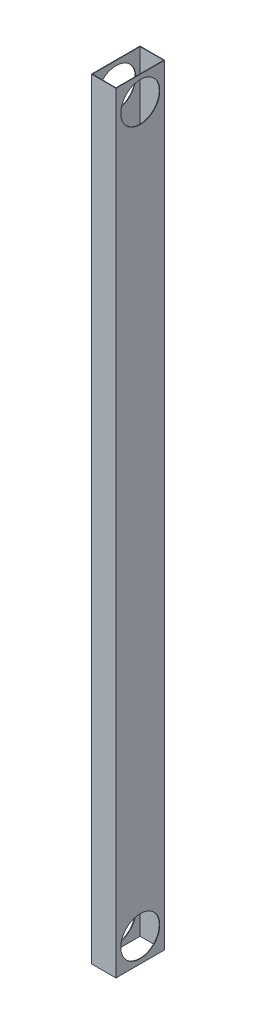
ISO-10303-21;
HEADER;
FILE_DESCRIPTION(('STEP AP214'),'2;1');
FILE_NAME('part.step','',(''),(''),'','','');
FILE_SCHEMA(('AUTOMOTIVE_DESIGN { 1 0 10303 214 1 1 1 1 }'));
ENDSEC;
DATA;
#1=APPLICATION_CONTEXT('core data for automotive mechanical design processes');
#2=APPLICATION_PROTOCOL_DEFINITION('international standard','automotive_design',2000,#1);
#3=PRODUCT_CONTEXT('',#1,'mechanical');
#4=PRODUCT('Part','Part','',(#3));
#5=PRODUCT_RELATED_PRODUCT_CATEGORY('part','',(#4));
#6=PRODUCT_DEFINITION_FORMATION('','',#4);
#7=PRODUCT_DEFINITION_CONTEXT('part definition',#1,'design');
#8=PRODUCT_DEFINITION('design','',#6,#7);
#9=PRODUCT_DEFINITION_SHAPE('','',#8);
#10=(LENGTH_UNIT() NAMED_UNIT(*) SI_UNIT(.MILLI.,.METRE.));
#11=(NAMED_UNIT(*) PLANE_ANGLE_UNIT() SI_UNIT($,.RADIAN.));
#12=(NAMED_UNIT(*) SI_UNIT($,.STERADIAN.) SOLID_ANGLE_UNIT());
#13=UNCERTAINTY_MEASURE_WITH_UNIT(LENGTH_MEASURE(1.E-05),#10,'distance_accuracy_value','');
#14=(GEOMETRIC_REPRESENTATION_CONTEXT(3) GLOBAL_UNCERTAINTY_ASSIGNED_CONTEXT((#13)) GLOBAL_UNIT_ASSIGNED_CONTEXT((#10,
#11,#12)) REPRESENTATION_CONTEXT('',''));
#15=CARTESIAN_POINT('',(0.,0.,0.));
#16=DIRECTION('',(0.,0.,1.));
#17=DIRECTION('',(1.,0.,0.));
#18=AXIS2_PLACEMENT_3D('',#15,#16,#17);
#19=CARTESIAN_POINT('',(25.5,1600.,0.));
#20=DIRECTION('',(1.,0.,0.));
#21=DIRECTION('',(0.,0.,-1.));
#22=AXIS2_PLACEMENT_3D('',#19,#20,#21);
#23=PLANE('',#22);
#24=CARTESIAN_POINT('',(25.5,50.,0.));
#25=DIRECTION('',(-1.,0.,0.));
#26=DIRECTION('',(0.,0.,1.));
#27=AXIS2_PLACEMENT_3D('',#24,#25,#26);
#28=CIRCLE('',#27,40.5);
#29=CARTESIAN_POINT('',(25.5,50.,40.5));
#30=VERTEX_POINT('',#29);
#31=EDGE_CURVE('E193',#30,#30,#28,.T.);
#32=ORIENTED_EDGE('',*,*,#31,.T.);
#33=EDGE_LOOP('',(#32));
#34=FACE_BOUND('',#33,.T.);
#35=CARTESIAN_POINT('',(25.5,1550.,0.));
#36=DIRECTION('',(-1.,0.,0.));
#37=DIRECTION('',(0.,0.,1.));
#38=AXIS2_PLACEMENT_3D('',#35,#36,#37);
#39=CIRCLE('',#38,40.5);
#40=CARTESIAN_POINT('',(25.5,1550.,40.5));
#41=VERTEX_POINT('',#40);
#42=EDGE_CURVE('E207',#41,#41,#39,.T.);
#43=ORIENTED_EDGE('',*,*,#42,.T.);
#44=EDGE_LOOP('',(#43));
#45=FACE_BOUND('',#44,.T.);
#46=DIRECTION('',(0.,0.,1.));
#47=VECTOR('',#46,1.);
#48=CARTESIAN_POINT('',(25.5,0.,0.));
#49=LINE('',#48,#47);
#50=CARTESIAN_POINT('',(25.5,0.,-50.5));
#51=VERTEX_POINT('',#50);
#52=CARTESIAN_POINT('',(25.5,0.,50.5));
#53=VERTEX_POINT('',#52);
#54=EDGE_CURVE('E164',#51,#53,#49,.T.);
#55=ORIENTED_EDGE('',*,*,#54,.F.);
#56=DIRECTION('',(0.,-1.,0.));
#57=VECTOR('',#56,1.);
#58=CARTESIAN_POINT('',(25.5,1600.,-50.5));
#59=LINE('',#58,#57);
#60=CARTESIAN_POINT('',(25.5,1600.,-50.5));
#61=VERTEX_POINT('',#60);
#62=EDGE_CURVE('E11',#61,#51,#59,.T.);
#63=ORIENTED_EDGE('',*,*,#62,.F.);
#64=DIRECTION('',(0.,0.,1.));
#65=VECTOR('',#64,1.);
#66=CARTESIAN_POINT('',(25.5,1600.,0.));
#67=LINE('',#66,#65);
#68=CARTESIAN_POINT('',(25.5,1600.,50.5));
#69=VERTEX_POINT('',#68);
#70=EDGE_CURVE('E137',#61,#69,#67,.T.);
#71=ORIENTED_EDGE('',*,*,#70,.T.);
#72=DIRECTION('',(0.,-1.,0.));
#73=VECTOR('',#72,1.);
#74=CARTESIAN_POINT('',(25.5,1600.,50.5));
#75=LINE('',#74,#73);
#76=EDGE_CURVE('E96',#69,#53,#75,.T.);
#77=ORIENTED_EDGE('',*,*,#76,.T.);
#78=EDGE_LOOP('',(#55,#63,#71,#77));
#79=FACE_BOUND('',#78,.T.);
#80=ADVANCED_FACE('F41',(#34,#45,#79),#23,.T.);
#81=CARTESIAN_POINT('',(0.,1600.,-50.5));
#82=DIRECTION('',(0.,0.,-1.));
#83=DIRECTION('',(-1.,0.,0.));
#84=AXIS2_PLACEMENT_3D('',#81,#82,#83);
#85=PLANE('',#84);
#86=DIRECTION('',(1.,0.,0.));
#87=VECTOR('',#86,1.);
#88=CARTESIAN_POINT('',(0.,0.,-50.5));
#89=LINE('',#88,#87);
#90=CARTESIAN_POINT('',(-25.5,0.,-50.5));
#91=VERTEX_POINT('',#90);
#92=EDGE_CURVE('E125',#91,#51,#89,.T.);
#93=ORIENTED_EDGE('',*,*,#92,.F.);
#94=DIRECTION('',(0.,-1.,0.));
#95=VECTOR('',#94,1.);
#96=CARTESIAN_POINT('',(-25.5,1600.,-50.5));
#97=LINE('',#96,#95);
#98=CARTESIAN_POINT('',(-25.5,1600.,-50.5));
#99=VERTEX_POINT('',#98);
#100=EDGE_CURVE('E52',#99,#91,#97,.T.);
#101=ORIENTED_EDGE('',*,*,#100,.F.);
#102=DIRECTION('',(1.,0.,0.));
#103=VECTOR('',#102,1.);
#104=CARTESIAN_POINT('',(0.,1600.,-50.5));
#105=LINE('',#104,#103);
#106=EDGE_CURVE('E123',#99,#61,#105,.T.);
#107=ORIENTED_EDGE('',*,*,#106,.T.);
#108=ORIENTED_EDGE('',*,*,#62,.T.);
#109=EDGE_LOOP('',(#93,#101,#107,#108));
#110=FACE_BOUND('',#109,.T.);
#111=ADVANCED_FACE('F121',(#110),#85,.T.);
#112=CARTESIAN_POINT('',(-25.5,1600.,0.));
#113=DIRECTION('',(1.,0.,0.));
#114=DIRECTION('',(0.,0.,-1.));
#115=AXIS2_PLACEMENT_3D('',#112,#113,#114);
#116=PLANE('',#115);
#117=CARTESIAN_POINT('',(-25.5,50.,0.));
#118=DIRECTION('',(-1.,0.,0.));
#119=DIRECTION('',(0.,0.,1.));
#120=AXIS2_PLACEMENT_3D('',#117,#118,#119);
#121=CIRCLE('',#120,40.5);
#122=CARTESIAN_POINT('',(-25.5,50.,40.5));
#123=VERTEX_POINT('',#122);
#124=EDGE_CURVE('E201',#123,#123,#121,.T.);
#125=ORIENTED_EDGE('',*,*,#124,.F.);
#126=EDGE_LOOP('',(#125));
#127=FACE_BOUND('',#126,.T.);
#128=CARTESIAN_POINT('',(-25.5,1550.,0.));
#129=DIRECTION('',(-1.,0.,0.));
#130=DIRECTION('',(0.,0.,1.));
#131=AXIS2_PLACEMENT_3D('',#128,#129,#130);
#132=CIRCLE('',#131,40.5);
#133=CARTESIAN_POINT('',(-25.5,1550.,40.5));
#134=VERTEX_POINT('',#133);
#135=EDGE_CURVE('E213',#134,#134,#132,.T.);
#136=ORIENTED_EDGE('',*,*,#135,.F.);
#137=EDGE_LOOP('',(#136));
#138=FACE_BOUND('',#137,.T.);
#139=DIRECTION('',(0.,0.,1.));
#140=VECTOR('',#139,1.);
#141=CARTESIAN_POINT('',(-25.5,0.,0.));
#142=LINE('',#141,#140);
#143=CARTESIAN_POINT('',(-25.5,0.,50.5));
#144=VERTEX_POINT('',#143);
#145=EDGE_CURVE('E169',#91,#144,#142,.T.);
#146=ORIENTED_EDGE('',*,*,#145,.T.);
#147=DIRECTION('',(0.,-1.,0.));
#148=VECTOR('',#147,1.);
#149=CARTESIAN_POINT('',(-25.5,1600.,50.5));
#150=LINE('',#149,#148);
#151=CARTESIAN_POINT('',(-25.5,1600.,50.5));
#152=VERTEX_POINT('',#151);
#153=EDGE_CURVE('E129',#152,#144,#150,.T.);
#154=ORIENTED_EDGE('',*,*,#153,.F.);
#155=DIRECTION('',(0.,0.,1.));
#156=VECTOR('',#155,1.);
#157=CARTESIAN_POINT('',(-25.5,1600.,0.));
#158=LINE('',#157,#156);
#159=EDGE_CURVE('E132',#99,#152,#158,.T.);
#160=ORIENTED_EDGE('',*,*,#159,.F.);
#161=ORIENTED_EDGE('',*,*,#100,.T.);
#162=EDGE_LOOP('',(#146,#154,#160,#161));
#163=FACE_BOUND('',#162,.T.);
#164=ADVANCED_FACE('F133',(#127,#138,#163),#116,.F.);
#165=CARTESIAN_POINT('',(-24.5,1600.,0.));
#166=DIRECTION('',(1.,0.,0.));
#167=DIRECTION('',(0.,0.,-1.));
#168=AXIS2_PLACEMENT_3D('',#165,#166,#167);
#169=PLANE('',#168);
#170=CARTESIAN_POINT('',(-24.5,50.,0.));
#171=DIRECTION('',(1.,0.,0.));
#172=DIRECTION('',(0.,0.,-1.));
#173=AXIS2_PLACEMENT_3D('',#170,#171,#172);
#174=CIRCLE('',#173,40.5);
#175=CARTESIAN_POINT('',(-24.5,50.,-40.5));
#176=VERTEX_POINT('',#175);
#177=EDGE_CURVE('E153',#176,#176,#174,.T.);
#178=ORIENTED_EDGE('',*,*,#177,.F.);
#179=EDGE_LOOP('',(#178));
#180=FACE_BOUND('',#179,.T.);
#181=CARTESIAN_POINT('',(-24.5,1550.,0.));
#182=DIRECTION('',(1.,0.,0.));
#183=DIRECTION('',(0.,0.,-1.));
#184=AXIS2_PLACEMENT_3D('',#181,#182,#183);
#185=CIRCLE('',#184,40.5);
#186=CARTESIAN_POINT('',(-24.5,1550.,-40.5));
#187=VERTEX_POINT('',#186);
#188=EDGE_CURVE('E192',#187,#187,#185,.T.);
#189=ORIENTED_EDGE('',*,*,#188,.F.);
#190=EDGE_LOOP('',(#189));
#191=FACE_BOUND('',#190,.T.);
#192=DIRECTION('',(0.,0.,1.));
#193=VECTOR('',#192,1.);
#194=CARTESIAN_POINT('',(-24.5,0.,0.));
#195=LINE('',#194,#193);
#196=CARTESIAN_POINT('',(-24.5,0.,-49.5));
#197=VERTEX_POINT('',#196);
#198=CARTESIAN_POINT('',(-24.5,0.,49.5));
#199=VERTEX_POINT('',#198);
#200=EDGE_CURVE('E148',#197,#199,#195,.T.);
#201=ORIENTED_EDGE('',*,*,#200,.F.);
#202=DIRECTION('',(0.,-1.,0.));
#203=VECTOR('',#202,1.);
#204=CARTESIAN_POINT('',(-24.5,1600.,-49.5));
#205=LINE('',#204,#203);
#206=CARTESIAN_POINT('',(-24.5,1600.,-49.5));
#207=VERTEX_POINT('',#206);
#208=EDGE_CURVE('E103',#207,#197,#205,.T.);
#209=ORIENTED_EDGE('',*,*,#208,.F.);
#210=DIRECTION('',(0.,0.,1.));
#211=VECTOR('',#210,1.);
#212=CARTESIAN_POINT('',(-24.5,1600.,0.));
#213=LINE('',#212,#211);
#214=CARTESIAN_POINT('',(-24.5,1600.,49.5));
#215=VERTEX_POINT('',#214);
#216=EDGE_CURVE('E174',#207,#215,#213,.T.);
#217=ORIENTED_EDGE('',*,*,#216,.T.);
#218=DIRECTION('',(0.,-1.,0.));
#219=VECTOR('',#218,1.);
#220=CARTESIAN_POINT('',(-24.5,1600.,49.5));
#221=LINE('',#220,#219);
#222=EDGE_CURVE('E147',#215,#199,#221,.T.);
#223=ORIENTED_EDGE('',*,*,#222,.T.);
#224=EDGE_LOOP('',(#201,#209,#217,#223));
#225=FACE_BOUND('',#224,.T.);
#226=ADVANCED_FACE('F43',(#180,#191,#225),#169,.T.);
#227=CARTESIAN_POINT('',(0.,1600.,-49.5));
#228=DIRECTION('',(0.,0.,-1.));
#229=DIRECTION('',(-1.,0.,0.));
#230=AXIS2_PLACEMENT_3D('',#227,#228,#229);
#231=PLANE('',#230);
#232=DIRECTION('',(1.,0.,0.));
#233=VECTOR('',#232,1.);
#234=CARTESIAN_POINT('',(0.,0.,-49.5));
#235=LINE('',#234,#233);
#236=CARTESIAN_POINT('',(24.5,0.,-49.5));
#237=VERTEX_POINT('',#236);
#238=EDGE_CURVE('E152',#197,#237,#235,.T.);
#239=ORIENTED_EDGE('',*,*,#238,.T.);
#240=DIRECTION('',(0.,-1.,0.));
#241=VECTOR('',#240,1.);
#242=CARTESIAN_POINT('',(24.5,1600.,-49.5));
#243=LINE('',#242,#241);
#244=CARTESIAN_POINT('',(24.5,1600.,-49.5));
#245=VERTEX_POINT('',#244);
#246=EDGE_CURVE('E184',#245,#237,#243,.T.);
#247=ORIENTED_EDGE('',*,*,#246,.F.);
#248=DIRECTION('',(1.,0.,0.));
#249=VECTOR('',#248,1.);
#250=CARTESIAN_POINT('',(0.,1600.,-49.5));
#251=LINE('',#250,#249);
#252=EDGE_CURVE('E222',#207,#245,#251,.T.);
#253=ORIENTED_EDGE('',*,*,#252,.F.);
#254=ORIENTED_EDGE('',*,*,#208,.T.);
#255=EDGE_LOOP('',(#239,#247,#253,#254));
#256=FACE_BOUND('',#255,.T.);
#257=ADVANCED_FACE('F245',(#256),#231,.F.);
#258=CARTESIAN_POINT('',(24.5,1600.,0.));
#259=DIRECTION('',(1.,0.,0.));
#260=DIRECTION('',(0.,0.,-1.));
#261=AXIS2_PLACEMENT_3D('',#258,#259,#260);
#262=PLANE('',#261);
#263=CARTESIAN_POINT('',(24.5,50.,0.));
#264=DIRECTION('',(1.,0.,0.));
#265=DIRECTION('',(0.,0.,-1.));
#266=AXIS2_PLACEMENT_3D('',#263,#264,#265);
#267=CIRCLE('',#266,40.5);
#268=CARTESIAN_POINT('',(24.5,50.,-40.5));
#269=VERTEX_POINT('',#268);
#270=EDGE_CURVE('E45',#269,#269,#267,.T.);
#271=ORIENTED_EDGE('',*,*,#270,.T.);
#272=EDGE_LOOP('',(#271));
#273=FACE_BOUND('',#272,.T.);
#274=CARTESIAN_POINT('',(24.5,1550.,0.));
#275=DIRECTION('',(1.,0.,0.));
#276=DIRECTION('',(0.,0.,-1.));
#277=AXIS2_PLACEMENT_3D('',#274,#275,#276);
#278=CIRCLE('',#277,40.5);
#279=CARTESIAN_POINT('',(24.5,1550.,-40.5));
#280=VERTEX_POINT('',#279);
#281=EDGE_CURVE('E189',#280,#280,#278,.T.);
#282=ORIENTED_EDGE('',*,*,#281,.T.);
#283=EDGE_LOOP('',(#282));
#284=FACE_BOUND('',#283,.T.);
#285=DIRECTION('',(0.,0.,1.));
#286=VECTOR('',#285,1.);
#287=CARTESIAN_POINT('',(24.5,0.,0.));
#288=LINE('',#287,#286);
#289=CARTESIAN_POINT('',(24.5,0.,49.5));
#290=VERTEX_POINT('',#289);
#291=EDGE_CURVE('E156',#237,#290,#288,.T.);
#292=ORIENTED_EDGE('',*,*,#291,.T.);
#293=DIRECTION('',(0.,-1.,0.));
#294=VECTOR('',#293,1.);
#295=CARTESIAN_POINT('',(24.5,1600.,49.5));
#296=LINE('',#295,#294);
#297=CARTESIAN_POINT('',(24.5,1600.,49.5));
#298=VERTEX_POINT('',#297);
#299=EDGE_CURVE('E181',#298,#290,#296,.T.);
#300=ORIENTED_EDGE('',*,*,#299,.F.);
#301=DIRECTION('',(0.,0.,1.));
#302=VECTOR('',#301,1.);
#303=CARTESIAN_POINT('',(24.5,1600.,0.));
#304=LINE('',#303,#302);
#305=EDGE_CURVE('E225',#245,#298,#304,.T.);
#306=ORIENTED_EDGE('',*,*,#305,.F.);
#307=ORIENTED_EDGE('',*,*,#246,.T.);
#308=EDGE_LOOP('',(#292,#300,#306,#307));
#309=FACE_BOUND('',#308,.T.);
#310=ADVANCED_FACE('F239',(#273,#284,#309),#262,.F.);
#311=CARTESIAN_POINT('',(0.,1600.,49.5));
#312=DIRECTION('',(0.,0.,-1.));
#313=DIRECTION('',(-1.,0.,0.));
#314=AXIS2_PLACEMENT_3D('',#311,#312,#313);
#315=PLANE('',#314);
#316=DIRECTION('',(1.,0.,0.));
#317=VECTOR('',#316,1.);
#318=CARTESIAN_POINT('',(0.,0.,49.5));
#319=LINE('',#318,#317);
#320=EDGE_CURVE('E160',#199,#290,#319,.T.);
#321=ORIENTED_EDGE('',*,*,#320,.F.);
#322=ORIENTED_EDGE('',*,*,#222,.F.);
#323=DIRECTION('',(1.,0.,0.));
#324=VECTOR('',#323,1.);
#325=CARTESIAN_POINT('',(0.,1600.,49.5));
#326=LINE('',#325,#324);
#327=EDGE_CURVE('E141',#215,#298,#326,.T.);
#328=ORIENTED_EDGE('',*,*,#327,.T.);
#329=ORIENTED_EDGE('',*,*,#299,.T.);
#330=EDGE_LOOP('',(#321,#322,#328,#329));
#331=FACE_BOUND('',#330,.T.);
#332=ADVANCED_FACE('F232',(#331),#315,.T.);
#333=CARTESIAN_POINT('',(0.,1600.,50.5));
#334=DIRECTION('',(0.,0.,-1.));
#335=DIRECTION('',(-1.,0.,0.));
#336=AXIS2_PLACEMENT_3D('',#333,#334,#335);
#337=PLANE('',#336);
#338=DIRECTION('',(1.,0.,0.));
#339=VECTOR('',#338,1.);
#340=CARTESIAN_POINT('',(0.,0.,50.5));
#341=LINE('',#340,#339);
#342=EDGE_CURVE('E89',#144,#53,#341,.T.);
#343=ORIENTED_EDGE('',*,*,#342,.T.);
#344=ORIENTED_EDGE('',*,*,#76,.F.);
#345=DIRECTION('',(1.,0.,0.));
#346=VECTOR('',#345,1.);
#347=CARTESIAN_POINT('',(0.,1600.,50.5));
#348=LINE('',#347,#346);
#349=EDGE_CURVE('E61',#152,#69,#348,.T.);
#350=ORIENTED_EDGE('',*,*,#349,.F.);
#351=ORIENTED_EDGE('',*,*,#153,.T.);
#352=EDGE_LOOP('',(#343,#344,#350,#351));
#353=FACE_BOUND('',#352,.T.);
#354=ADVANCED_FACE('F266',(#353),#337,.F.);
#355=CARTESIAN_POINT('',(0.,1600.,0.));
#356=DIRECTION('',(0.,1.,0.));
#357=DIRECTION('',(0.,0.,1.));
#358=AXIS2_PLACEMENT_3D('',#355,#356,#357);
#359=PLANE('',#358);
#360=ORIENTED_EDGE('',*,*,#216,.F.);
#361=ORIENTED_EDGE('',*,*,#252,.T.);
#362=ORIENTED_EDGE('',*,*,#305,.T.);
#363=ORIENTED_EDGE('',*,*,#327,.F.);
#364=EDGE_LOOP('',(#360,#361,#362,#363));
#365=FACE_BOUND('',#364,.T.);
#366=ORIENTED_EDGE('',*,*,#70,.F.);
#367=ORIENTED_EDGE('',*,*,#106,.F.);
#368=ORIENTED_EDGE('',*,*,#159,.T.);
#369=ORIENTED_EDGE('',*,*,#349,.T.);
#370=EDGE_LOOP('',(#366,#367,#368,#369));
#371=FACE_BOUND('',#370,.T.);
#372=ADVANCED_FACE('F136',(#365,#371),#359,.T.);
#373=CARTESIAN_POINT('',(0.,0.,0.));
#374=DIRECTION('',(0.,1.,0.));
#375=DIRECTION('',(0.,0.,1.));
#376=AXIS2_PLACEMENT_3D('',#373,#374,#375);
#377=PLANE('',#376);
#378=ORIENTED_EDGE('',*,*,#200,.T.);
#379=ORIENTED_EDGE('',*,*,#320,.T.);
#380=ORIENTED_EDGE('',*,*,#291,.F.);
#381=ORIENTED_EDGE('',*,*,#238,.F.);
#382=EDGE_LOOP('',(#378,#379,#380,#381));
#383=FACE_BOUND('',#382,.T.);
#384=ORIENTED_EDGE('',*,*,#54,.T.);
#385=ORIENTED_EDGE('',*,*,#342,.F.);
#386=ORIENTED_EDGE('',*,*,#145,.F.);
#387=ORIENTED_EDGE('',*,*,#92,.T.);
#388=EDGE_LOOP('',(#384,#385,#386,#387));
#389=FACE_BOUND('',#388,.T.);
#390=ADVANCED_FACE('F243',(#383,#389),#377,.F.);
#391=CARTESIAN_POINT('',(25.5,1550.,0.));
#392=DIRECTION('',(-1.,0.,0.));
#393=DIRECTION('',(0.,0.,1.));
#394=AXIS2_PLACEMENT_3D('',#391,#392,#393);
#395=CYLINDRICAL_SURFACE('',#394,40.5);
#396=ORIENTED_EDGE('',*,*,#42,.F.);
#397=EDGE_LOOP('',(#396));
#398=FACE_BOUND('',#397,.T.);
#399=ORIENTED_EDGE('',*,*,#281,.F.);
#400=EDGE_LOOP('',(#399));
#401=FACE_BOUND('',#400,.T.);
#402=ADVANCED_FACE('F278',(#398,#401),#395,.F.);
#403=CARTESIAN_POINT('',(25.5,50.,0.));
#404=DIRECTION('',(-1.,0.,0.));
#405=DIRECTION('',(0.,0.,1.));
#406=AXIS2_PLACEMENT_3D('',#403,#404,#405);
#407=CYLINDRICAL_SURFACE('',#406,40.5);
#408=ORIENTED_EDGE('',*,*,#31,.F.);
#409=EDGE_LOOP('',(#408));
#410=FACE_BOUND('',#409,.T.);
#411=ORIENTED_EDGE('',*,*,#270,.F.);
#412=EDGE_LOOP('',(#411));
#413=FACE_BOUND('',#412,.T.);
#414=ADVANCED_FACE('F275',(#410,#413),#407,.F.);
#415=ORIENTED_EDGE('',*,*,#188,.T.);
#416=EDGE_LOOP('',(#415));
#417=FACE_BOUND('',#416,.T.);
#418=ORIENTED_EDGE('',*,*,#135,.T.);
#419=EDGE_LOOP('',(#418));
#420=FACE_BOUND('',#419,.T.);
#421=ADVANCED_FACE('F277',(#417,#420),#395,.F.);
#422=ORIENTED_EDGE('',*,*,#177,.T.);
#423=EDGE_LOOP('',(#422));
#424=FACE_BOUND('',#423,.T.);
#425=ORIENTED_EDGE('',*,*,#124,.T.);
#426=EDGE_LOOP('',(#425));
#427=FACE_BOUND('',#426,.T.);
#428=ADVANCED_FACE('F281',(#424,#427),#407,.F.);
#429=CLOSED_SHELL('',(#80,#111,#164,#226,#257,#310,#332,#354,#372,#390,#402,#414,#421,#428));
#430=MANIFOLD_SOLID_BREP('B2',#429);
#431=ADVANCED_BREP_SHAPE_REPRESENTATION('',(#18,#430),#14);
#432=SHAPE_DEFINITION_REPRESENTATION(#9,#431);
ENDSEC;
END-ISO-10303-21;
